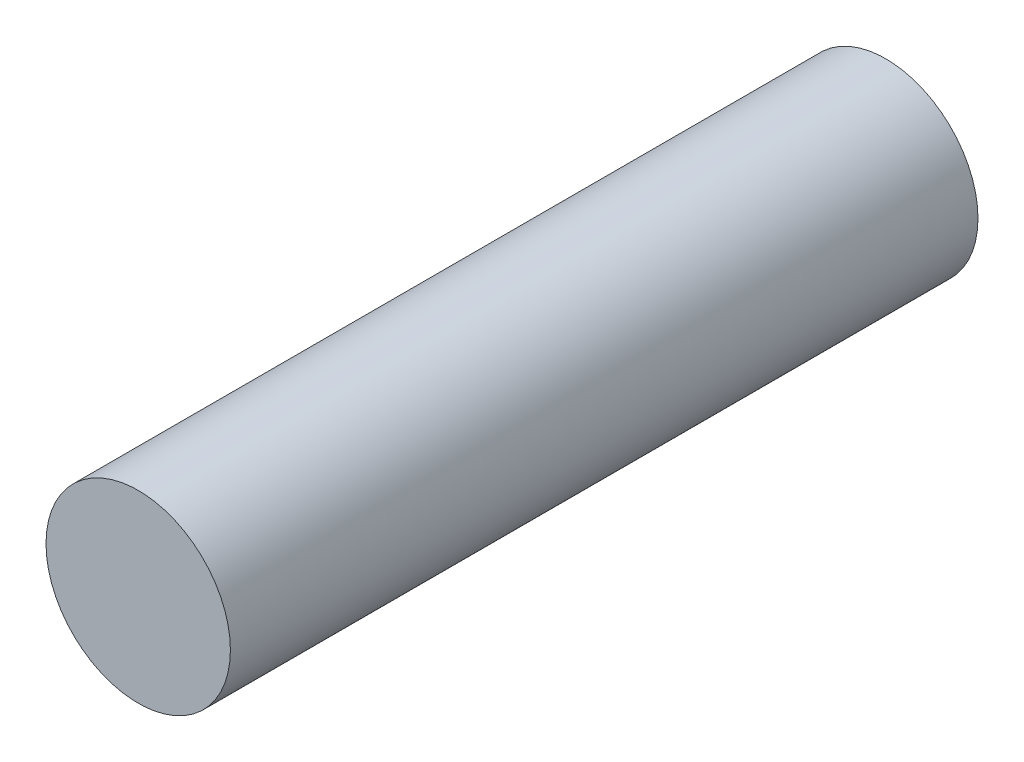
ISO-10303-21;
HEADER;
FILE_DESCRIPTION(('STEP AP214'),'2;1');
FILE_NAME('part.step','',(''),(''),'','','');
FILE_SCHEMA(('AUTOMOTIVE_DESIGN { 1 0 10303 214 1 1 1 1 }'));
ENDSEC;
DATA;
#1=APPLICATION_CONTEXT('core data for automotive mechanical design processes');
#2=APPLICATION_PROTOCOL_DEFINITION('international standard','automotive_design',2000,#1);
#3=PRODUCT_CONTEXT('',#1,'mechanical');
#4=PRODUCT('Part','Part','',(#3));
#5=PRODUCT_RELATED_PRODUCT_CATEGORY('part','',(#4));
#6=PRODUCT_DEFINITION_FORMATION('','',#4);
#7=PRODUCT_DEFINITION_CONTEXT('part definition',#1,'design');
#8=PRODUCT_DEFINITION('design','',#6,#7);
#9=PRODUCT_DEFINITION_SHAPE('','',#8);
#10=(LENGTH_UNIT() NAMED_UNIT(*) SI_UNIT(.MILLI.,.METRE.));
#11=(NAMED_UNIT(*) PLANE_ANGLE_UNIT() SI_UNIT($,.RADIAN.));
#12=(NAMED_UNIT(*) SI_UNIT($,.STERADIAN.) SOLID_ANGLE_UNIT());
#13=UNCERTAINTY_MEASURE_WITH_UNIT(LENGTH_MEASURE(1.E-05),#10,'distance_accuracy_value','');
#14=(GEOMETRIC_REPRESENTATION_CONTEXT(3) GLOBAL_UNCERTAINTY_ASSIGNED_CONTEXT((#13)) GLOBAL_UNIT_ASSIGNED_CONTEXT((#10,
#11,#12)) REPRESENTATION_CONTEXT('',''));
#15=CARTESIAN_POINT('',(0.,0.,0.));
#16=DIRECTION('',(0.,0.,1.));
#17=DIRECTION('',(1.,0.,0.));
#18=AXIS2_PLACEMENT_3D('',#15,#16,#17);
#19=CARTESIAN_POINT('',(0.,0.,38.1));
#20=DIRECTION('',(0.,0.,-1.));
#21=DIRECTION('',(-1.,0.,0.));
#22=AXIS2_PLACEMENT_3D('',#19,#20,#21);
#23=CYLINDRICAL_SURFACE('',#22,4.699);
#24=CARTESIAN_POINT('',(0.,0.,38.1));
#25=DIRECTION('',(0.,0.,1.));
#26=DIRECTION('',(1.,0.,0.));
#27=AXIS2_PLACEMENT_3D('',#24,#25,#26);
#28=CIRCLE('',#27,4.699);
#29=CARTESIAN_POINT('',(4.699,0.,38.1));
#30=VERTEX_POINT('',#29);
#31=EDGE_CURVE('E10',#30,#30,#28,.T.);
#32=ORIENTED_EDGE('',*,*,#31,.F.);
#33=EDGE_LOOP('',(#32));
#34=FACE_BOUND('',#33,.T.);
#35=CARTESIAN_POINT('',(0.,0.,0.));
#36=DIRECTION('',(0.,0.,1.));
#37=DIRECTION('',(1.,0.,0.));
#38=AXIS2_PLACEMENT_3D('',#35,#36,#37);
#39=CIRCLE('',#38,4.699);
#40=CARTESIAN_POINT('',(4.699,0.,0.));
#41=VERTEX_POINT('',#40);
#42=EDGE_CURVE('E41',#41,#41,#39,.T.);
#43=ORIENTED_EDGE('',*,*,#42,.T.);
#44=EDGE_LOOP('',(#43));
#45=FACE_BOUND('',#44,.T.);
#46=ADVANCED_FACE('F38',(#34,#45),#23,.T.);
#47=CARTESIAN_POINT('',(0.,0.,38.1));
#48=DIRECTION('',(0.,0.,1.));
#49=DIRECTION('',(1.,0.,0.));
#50=AXIS2_PLACEMENT_3D('',#47,#48,#49);
#51=PLANE('',#50);
#52=ORIENTED_EDGE('',*,*,#31,.T.);
#53=EDGE_LOOP('',(#52));
#54=FACE_BOUND('',#53,.T.);
#55=ADVANCED_FACE('F53',(#54),#51,.T.);
#56=CARTESIAN_POINT('',(0.,0.,0.));
#57=DIRECTION('',(0.,0.,1.));
#58=DIRECTION('',(1.,0.,0.));
#59=AXIS2_PLACEMENT_3D('',#56,#57,#58);
#60=PLANE('',#59);
#61=ORIENTED_EDGE('',*,*,#42,.F.);
#62=EDGE_LOOP('',(#61));
#63=FACE_BOUND('',#62,.T.);
#64=ADVANCED_FACE('F51',(#63),#60,.F.);
#65=CLOSED_SHELL('',(#46,#55,#64));
#66=MANIFOLD_SOLID_BREP('B2',#65);
#67=ADVANCED_BREP_SHAPE_REPRESENTATION('',(#18,#66),#14);
#68=SHAPE_DEFINITION_REPRESENTATION(#9,#67);
ENDSEC;
END-ISO-10303-21;
